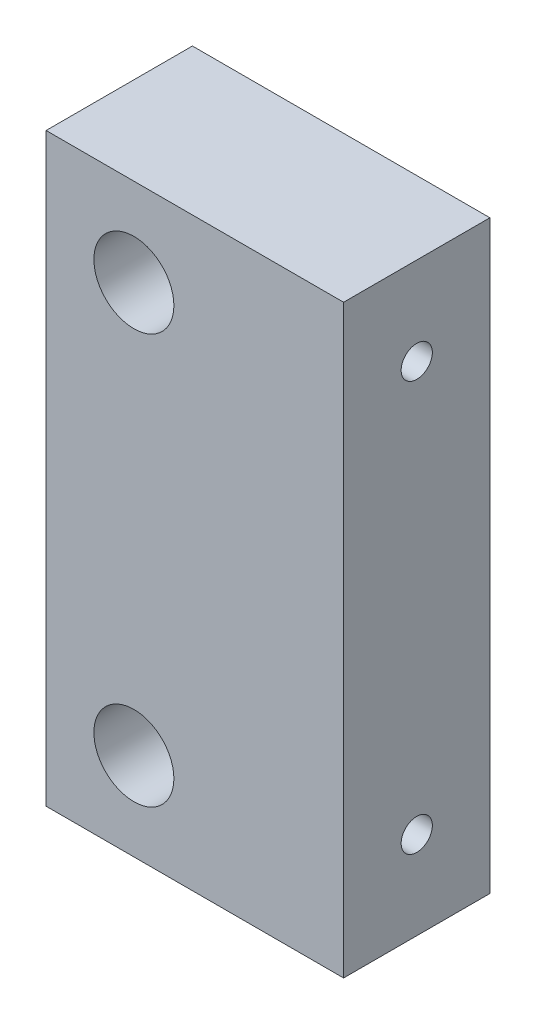
ISO-10303-21;
HEADER;
FILE_DESCRIPTION(('STEP AP214'),'2;1');
FILE_NAME('part.step','',(''),(''),'','','');
FILE_SCHEMA(('AUTOMOTIVE_DESIGN { 1 0 10303 214 1 1 1 1 }'));
ENDSEC;
DATA;
#1=APPLICATION_CONTEXT('core data for automotive mechanical design processes');
#2=APPLICATION_PROTOCOL_DEFINITION('international standard','automotive_design',2000,#1);
#3=PRODUCT_CONTEXT('',#1,'mechanical');
#4=PRODUCT('Part','Part','',(#3));
#5=PRODUCT_RELATED_PRODUCT_CATEGORY('part','',(#4));
#6=PRODUCT_DEFINITION_FORMATION('','',#4);
#7=PRODUCT_DEFINITION_CONTEXT('part definition',#1,'design');
#8=PRODUCT_DEFINITION('design','',#6,#7);
#9=PRODUCT_DEFINITION_SHAPE('','',#8);
#10=(LENGTH_UNIT() NAMED_UNIT(*) SI_UNIT(.MILLI.,.METRE.));
#11=(NAMED_UNIT(*) PLANE_ANGLE_UNIT() SI_UNIT($,.RADIAN.));
#12=(NAMED_UNIT(*) SI_UNIT($,.STERADIAN.) SOLID_ANGLE_UNIT());
#13=UNCERTAINTY_MEASURE_WITH_UNIT(LENGTH_MEASURE(1.E-05),#10,'distance_accuracy_value','');
#14=(GEOMETRIC_REPRESENTATION_CONTEXT(3) GLOBAL_UNCERTAINTY_ASSIGNED_CONTEXT((#13)) GLOBAL_UNIT_ASSIGNED_CONTEXT((#10,
#11,#12)) REPRESENTATION_CONTEXT('',''));
#15=CARTESIAN_POINT('',(0.,0.,0.));
#16=DIRECTION('',(0.,0.,1.));
#17=DIRECTION('',(1.,0.,0.));
#18=AXIS2_PLACEMENT_3D('',#15,#16,#17);
#19=CARTESIAN_POINT('',(-15.25,60.,-7.5));
#20=DIRECTION('',(1.,0.,0.));
#21=DIRECTION('',(0.,0.,-1.));
#22=AXIS2_PLACEMENT_3D('',#19,#20,#21);
#23=PLANE('',#22);
#24=DIRECTION('',(0.,0.,1.));
#25=VECTOR('',#24,1.);
#26=CARTESIAN_POINT('',(-15.25,0.,-7.5));
#27=LINE('',#26,#25);
#28=CARTESIAN_POINT('',(-15.25,0.,-7.5));
#29=VERTEX_POINT('',#28);
#30=CARTESIAN_POINT('',(-15.25,0.,7.5));
#31=VERTEX_POINT('',#30);
#32=EDGE_CURVE('E97',#29,#31,#27,.T.);
#33=ORIENTED_EDGE('',*,*,#32,.T.);
#34=DIRECTION('',(0.,-1.,0.));
#35=VECTOR('',#34,1.);
#36=CARTESIAN_POINT('',(-15.25,60.,7.5));
#37=LINE('',#36,#35);
#38=CARTESIAN_POINT('',(-15.25,60.,7.5));
#39=VERTEX_POINT('',#38);
#40=EDGE_CURVE('E11',#39,#31,#37,.T.);
#41=ORIENTED_EDGE('',*,*,#40,.F.);
#42=DIRECTION('',(0.,0.,1.));
#43=VECTOR('',#42,1.);
#44=CARTESIAN_POINT('',(-15.25,60.,-7.5));
#45=LINE('',#44,#43);
#46=CARTESIAN_POINT('',(-15.25,60.,-7.5));
#47=VERTEX_POINT('',#46);
#48=EDGE_CURVE('E85',#47,#39,#45,.T.);
#49=ORIENTED_EDGE('',*,*,#48,.F.);
#50=DIRECTION('',(0.,-1.,0.));
#51=VECTOR('',#50,1.);
#52=CARTESIAN_POINT('',(-15.25,60.,-7.5));
#53=LINE('',#52,#51);
#54=EDGE_CURVE('E93',#47,#29,#53,.T.);
#55=ORIENTED_EDGE('',*,*,#54,.T.);
#56=EDGE_LOOP('',(#33,#41,#49,#55));
#57=FACE_BOUND('',#56,.T.);
#58=ADVANCED_FACE('F34',(#57),#23,.F.);
#59=CARTESIAN_POINT('',(-15.25,60.,7.5));
#60=DIRECTION('',(0.,0.,-1.));
#61=DIRECTION('',(-1.,0.,0.));
#62=AXIS2_PLACEMENT_3D('',#59,#60,#61);
#63=PLANE('',#62);
#64=CARTESIAN_POINT('',(-6.25,9.,7.5));
#65=DIRECTION('',(0.,0.,1.));
#66=DIRECTION('',(1.,0.,0.));
#67=AXIS2_PLACEMENT_3D('',#64,#65,#66);
#68=CIRCLE('',#67,4.1);
#69=CARTESIAN_POINT('',(-2.15,9.,7.5));
#70=VERTEX_POINT('',#69);
#71=EDGE_CURVE('E117',#70,#70,#68,.T.);
#72=ORIENTED_EDGE('',*,*,#71,.F.);
#73=EDGE_LOOP('',(#72));
#74=FACE_BOUND('',#73,.T.);
#75=CARTESIAN_POINT('',(-6.25,51.,7.5));
#76=DIRECTION('',(0.,0.,1.));
#77=DIRECTION('',(1.,0.,0.));
#78=AXIS2_PLACEMENT_3D('',#75,#76,#77);
#79=CIRCLE('',#78,4.1);
#80=CARTESIAN_POINT('',(-2.15,51.,7.5));
#81=VERTEX_POINT('',#80);
#82=EDGE_CURVE('E111',#81,#81,#79,.T.);
#83=ORIENTED_EDGE('',*,*,#82,.F.);
#84=EDGE_LOOP('',(#83));
#85=FACE_BOUND('',#84,.T.);
#86=DIRECTION('',(1.,0.,0.));
#87=VECTOR('',#86,1.);
#88=CARTESIAN_POINT('',(-15.25,0.,7.5));
#89=LINE('',#88,#87);
#90=CARTESIAN_POINT('',(15.25,0.,7.5));
#91=VERTEX_POINT('',#90);
#92=EDGE_CURVE('E89',#31,#91,#89,.T.);
#93=ORIENTED_EDGE('',*,*,#92,.T.);
#94=DIRECTION('',(0.,-1.,0.));
#95=VECTOR('',#94,1.);
#96=CARTESIAN_POINT('',(15.25,60.,7.5));
#97=LINE('',#96,#95);
#98=CARTESIAN_POINT('',(15.25,60.,7.5));
#99=VERTEX_POINT('',#98);
#100=EDGE_CURVE('E42',#99,#91,#97,.T.);
#101=ORIENTED_EDGE('',*,*,#100,.F.);
#102=DIRECTION('',(1.,0.,0.));
#103=VECTOR('',#102,1.);
#104=CARTESIAN_POINT('',(-15.25,60.,7.5));
#105=LINE('',#104,#103);
#106=EDGE_CURVE('E80',#39,#99,#105,.T.);
#107=ORIENTED_EDGE('',*,*,#106,.F.);
#108=ORIENTED_EDGE('',*,*,#40,.T.);
#109=EDGE_LOOP('',(#93,#101,#107,#108));
#110=FACE_BOUND('',#109,.T.);
#111=ADVANCED_FACE('F88',(#74,#85,#110),#63,.F.);
#112=CARTESIAN_POINT('',(15.25,60.,-7.5));
#113=DIRECTION('',(-1.,0.,0.));
#114=DIRECTION('',(0.,0.,1.));
#115=AXIS2_PLACEMENT_3D('',#112,#113,#114);
#116=PLANE('',#115);
#117=CARTESIAN_POINT('',(15.25,9.,0.));
#118=DIRECTION('',(1.,0.,0.));
#119=DIRECTION('',(0.,0.,-1.));
#120=AXIS2_PLACEMENT_3D('',#117,#118,#119);
#121=CIRCLE('',#120,1.6);
#122=CARTESIAN_POINT('',(15.25,9.,-1.6));
#123=VERTEX_POINT('',#122);
#124=EDGE_CURVE('E129',#123,#123,#121,.T.);
#125=ORIENTED_EDGE('',*,*,#124,.F.);
#126=EDGE_LOOP('',(#125));
#127=FACE_BOUND('',#126,.T.);
#128=CARTESIAN_POINT('',(15.25,51.,0.));
#129=DIRECTION('',(1.,0.,0.));
#130=DIRECTION('',(0.,0.,-1.));
#131=AXIS2_PLACEMENT_3D('',#128,#129,#130);
#132=CIRCLE('',#131,1.6);
#133=CARTESIAN_POINT('',(15.25,51.,-1.6));
#134=VERTEX_POINT('',#133);
#135=EDGE_CURVE('E123',#134,#134,#132,.T.);
#136=ORIENTED_EDGE('',*,*,#135,.F.);
#137=EDGE_LOOP('',(#136));
#138=FACE_BOUND('',#137,.T.);
#139=DIRECTION('',(0.,0.,-1.));
#140=VECTOR('',#139,1.);
#141=CARTESIAN_POINT('',(15.25,0.,-7.5));
#142=LINE('',#141,#140);
#143=CARTESIAN_POINT('',(15.25,0.,-7.5));
#144=VERTEX_POINT('',#143);
#145=EDGE_CURVE('E67',#91,#144,#142,.T.);
#146=ORIENTED_EDGE('',*,*,#145,.T.);
#147=DIRECTION('',(0.,-1.,0.));
#148=VECTOR('',#147,1.);
#149=CARTESIAN_POINT('',(15.25,60.,-7.5));
#150=LINE('',#149,#148);
#151=CARTESIAN_POINT('',(15.25,60.,-7.5));
#152=VERTEX_POINT('',#151);
#153=EDGE_CURVE('E90',#152,#144,#150,.T.);
#154=ORIENTED_EDGE('',*,*,#153,.F.);
#155=DIRECTION('',(0.,0.,-1.));
#156=VECTOR('',#155,1.);
#157=CARTESIAN_POINT('',(15.25,60.,-7.5));
#158=LINE('',#157,#156);
#159=EDGE_CURVE('E83',#99,#152,#158,.T.);
#160=ORIENTED_EDGE('',*,*,#159,.F.);
#161=ORIENTED_EDGE('',*,*,#100,.T.);
#162=EDGE_LOOP('',(#146,#154,#160,#161));
#163=FACE_BOUND('',#162,.T.);
#164=ADVANCED_FACE('F91',(#127,#138,#163),#116,.F.);
#165=CARTESIAN_POINT('',(-15.25,60.,-7.5));
#166=DIRECTION('',(0.,0.,1.));
#167=DIRECTION('',(1.,0.,0.));
#168=AXIS2_PLACEMENT_3D('',#165,#166,#167);
#169=PLANE('',#168);
#170=CARTESIAN_POINT('',(-6.25,9.,-7.5));
#171=DIRECTION('',(0.,0.,1.));
#172=DIRECTION('',(1.,0.,0.));
#173=AXIS2_PLACEMENT_3D('',#170,#171,#172);
#174=CIRCLE('',#173,4.1);
#175=CARTESIAN_POINT('',(-2.15,9.,-7.5));
#176=VERTEX_POINT('',#175);
#177=EDGE_CURVE('E114',#176,#176,#174,.T.);
#178=ORIENTED_EDGE('',*,*,#177,.T.);
#179=EDGE_LOOP('',(#178));
#180=FACE_BOUND('',#179,.T.);
#181=CARTESIAN_POINT('',(-6.25,51.,-7.5));
#182=DIRECTION('',(0.,0.,1.));
#183=DIRECTION('',(1.,0.,0.));
#184=AXIS2_PLACEMENT_3D('',#181,#182,#183);
#185=CIRCLE('',#184,4.1);
#186=CARTESIAN_POINT('',(-2.15,51.,-7.5));
#187=VERTEX_POINT('',#186);
#188=EDGE_CURVE('E100',#187,#187,#185,.T.);
#189=ORIENTED_EDGE('',*,*,#188,.T.);
#190=EDGE_LOOP('',(#189));
#191=FACE_BOUND('',#190,.T.);
#192=DIRECTION('',(-1.,0.,0.));
#193=VECTOR('',#192,1.);
#194=CARTESIAN_POINT('',(-15.25,0.,-7.5));
#195=LINE('',#194,#193);
#196=EDGE_CURVE('E73',#144,#29,#195,.T.);
#197=ORIENTED_EDGE('',*,*,#196,.T.);
#198=ORIENTED_EDGE('',*,*,#54,.F.);
#199=DIRECTION('',(-1.,0.,0.));
#200=VECTOR('',#199,1.);
#201=CARTESIAN_POINT('',(-15.25,60.,-7.5));
#202=LINE('',#201,#200);
#203=EDGE_CURVE('E50',#152,#47,#202,.T.);
#204=ORIENTED_EDGE('',*,*,#203,.F.);
#205=ORIENTED_EDGE('',*,*,#153,.T.);
#206=EDGE_LOOP('',(#197,#198,#204,#205));
#207=FACE_BOUND('',#206,.T.);
#208=ADVANCED_FACE('F105',(#180,#191,#207),#169,.F.);
#209=CARTESIAN_POINT('',(-15.25,60.,7.5));
#210=DIRECTION('',(0.,1.,0.));
#211=DIRECTION('',(0.,0.,1.));
#212=AXIS2_PLACEMENT_3D('',#209,#210,#211);
#213=PLANE('',#212);
#214=ORIENTED_EDGE('',*,*,#48,.T.);
#215=ORIENTED_EDGE('',*,*,#106,.T.);
#216=ORIENTED_EDGE('',*,*,#159,.T.);
#217=ORIENTED_EDGE('',*,*,#203,.T.);
#218=EDGE_LOOP('',(#214,#215,#216,#217));
#219=FACE_BOUND('',#218,.T.);
#220=ADVANCED_FACE('F81',(#219),#213,.T.);
#221=CARTESIAN_POINT('',(-15.25,0.,7.5));
#222=DIRECTION('',(0.,1.,0.));
#223=DIRECTION('',(0.,0.,1.));
#224=AXIS2_PLACEMENT_3D('',#221,#222,#223);
#225=PLANE('',#224);
#226=ORIENTED_EDGE('',*,*,#32,.F.);
#227=ORIENTED_EDGE('',*,*,#196,.F.);
#228=ORIENTED_EDGE('',*,*,#145,.F.);
#229=ORIENTED_EDGE('',*,*,#92,.F.);
#230=EDGE_LOOP('',(#226,#227,#228,#229));
#231=FACE_BOUND('',#230,.T.);
#232=ADVANCED_FACE('F108',(#231),#225,.F.);
#233=CARTESIAN_POINT('',(-6.25,51.,-7.5));
#234=DIRECTION('',(0.,0.,1.));
#235=DIRECTION('',(1.,0.,0.));
#236=AXIS2_PLACEMENT_3D('',#233,#234,#235);
#237=CYLINDRICAL_SURFACE('',#236,4.1);
#238=ORIENTED_EDGE('',*,*,#188,.F.);
#239=EDGE_LOOP('',(#238));
#240=FACE_BOUND('',#239,.T.);
#241=ORIENTED_EDGE('',*,*,#82,.T.);
#242=EDGE_LOOP('',(#241));
#243=FACE_BOUND('',#242,.T.);
#244=ADVANCED_FACE('F160',(#240,#243),#237,.F.);
#245=CARTESIAN_POINT('',(-6.25,9.,-7.5));
#246=DIRECTION('',(0.,0.,1.));
#247=DIRECTION('',(1.,0.,0.));
#248=AXIS2_PLACEMENT_3D('',#245,#246,#247);
#249=CYLINDRICAL_SURFACE('',#248,4.1);
#250=ORIENTED_EDGE('',*,*,#177,.F.);
#251=EDGE_LOOP('',(#250));
#252=FACE_BOUND('',#251,.T.);
#253=ORIENTED_EDGE('',*,*,#71,.T.);
#254=EDGE_LOOP('',(#253));
#255=FACE_BOUND('',#254,.T.);
#256=ADVANCED_FACE('F151',(#252,#255),#249,.F.);
#257=CARTESIAN_POINT('',(0.25,51.,0.));
#258=DIRECTION('',(1.,0.,0.));
#259=DIRECTION('',(0.,0.,-1.));
#260=AXIS2_PLACEMENT_3D('',#257,#258,#259);
#261=CYLINDRICAL_SURFACE('',#260,1.6);
#262=CARTESIAN_POINT('',(0.25,51.,0.));
#263=DIRECTION('',(1.,0.,0.));
#264=DIRECTION('',(0.,0.,-1.));
#265=AXIS2_PLACEMENT_3D('',#262,#263,#264);
#266=CIRCLE('',#265,1.6);
#267=CARTESIAN_POINT('',(0.25,51.,-1.6));
#268=VERTEX_POINT('',#267);
#269=EDGE_CURVE('E120',#268,#268,#266,.T.);
#270=ORIENTED_EDGE('',*,*,#269,.F.);
#271=EDGE_LOOP('',(#270));
#272=FACE_BOUND('',#271,.T.);
#273=ORIENTED_EDGE('',*,*,#135,.T.);
#274=EDGE_LOOP('',(#273));
#275=FACE_BOUND('',#274,.T.);
#276=ADVANCED_FACE('F149',(#272,#275),#261,.F.);
#277=CARTESIAN_POINT('',(0.25,51.,0.));
#278=DIRECTION('',(1.,0.,0.));
#279=DIRECTION('',(0.,0.,-1.));
#280=AXIS2_PLACEMENT_3D('',#277,#278,#279);
#281=PLANE('',#280);
#282=ORIENTED_EDGE('',*,*,#269,.T.);
#283=EDGE_LOOP('',(#282));
#284=FACE_BOUND('',#283,.T.);
#285=ADVANCED_FACE('F140',(#284),#281,.T.);
#286=CARTESIAN_POINT('',(0.25,9.,0.));
#287=DIRECTION('',(1.,0.,0.));
#288=DIRECTION('',(0.,0.,-1.));
#289=AXIS2_PLACEMENT_3D('',#286,#287,#288);
#290=CYLINDRICAL_SURFACE('',#289,1.6);
#291=CARTESIAN_POINT('',(0.25,9.,0.));
#292=DIRECTION('',(1.,0.,0.));
#293=DIRECTION('',(0.,0.,-1.));
#294=AXIS2_PLACEMENT_3D('',#291,#292,#293);
#295=CIRCLE('',#294,1.6);
#296=CARTESIAN_POINT('',(0.25,9.,-1.6));
#297=VERTEX_POINT('',#296);
#298=EDGE_CURVE('E126',#297,#297,#295,.T.);
#299=ORIENTED_EDGE('',*,*,#298,.F.);
#300=EDGE_LOOP('',(#299));
#301=FACE_BOUND('',#300,.T.);
#302=ORIENTED_EDGE('',*,*,#124,.T.);
#303=EDGE_LOOP('',(#302));
#304=FACE_BOUND('',#303,.T.);
#305=ADVANCED_FACE('F137',(#301,#304),#290,.F.);
#306=CARTESIAN_POINT('',(0.25,9.,0.));
#307=DIRECTION('',(1.,0.,0.));
#308=DIRECTION('',(0.,0.,-1.));
#309=AXIS2_PLACEMENT_3D('',#306,#307,#308);
#310=PLANE('',#309);
#311=ORIENTED_EDGE('',*,*,#298,.T.);
#312=EDGE_LOOP('',(#311));
#313=FACE_BOUND('',#312,.T.);
#314=ADVANCED_FACE('F135',(#313),#310,.T.);
#315=CLOSED_SHELL('',(#58,#111,#164,#208,#220,#232,#244,#256,#276,#285,#305,#314));
#316=MANIFOLD_SOLID_BREP('B2',#315);
#317=ADVANCED_BREP_SHAPE_REPRESENTATION('',(#18,#316),#14);
#318=SHAPE_DEFINITION_REPRESENTATION(#9,#317);
ENDSEC;
END-ISO-10303-21;
